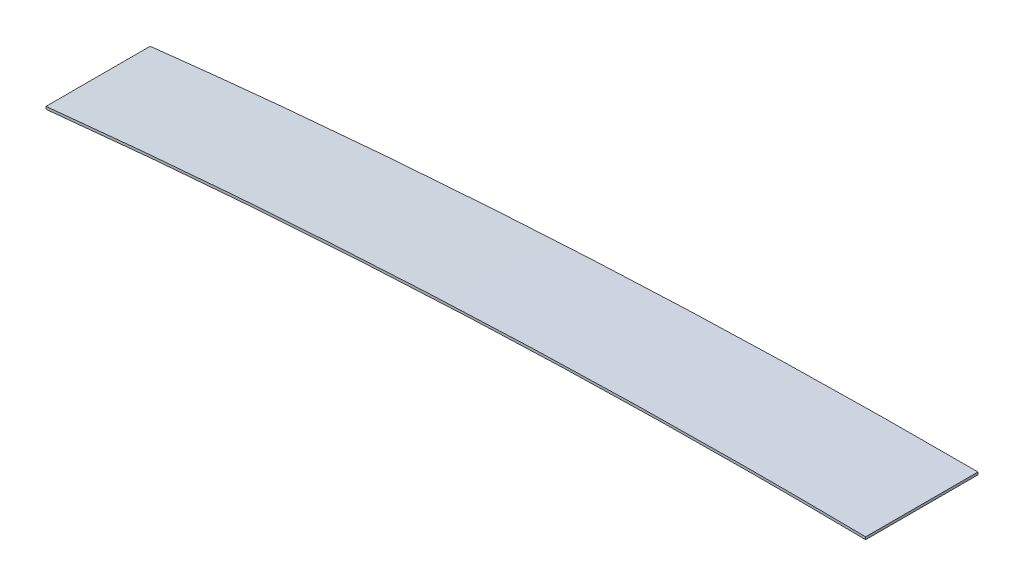
ISO-10303-21;
HEADER;
FILE_DESCRIPTION(('STEP AP214'),'2;1');
FILE_NAME('part.step','',(''),(''),'','','');
FILE_SCHEMA(('AUTOMOTIVE_DESIGN { 1 0 10303 214 1 1 1 1 }'));
ENDSEC;
DATA;
#1=APPLICATION_CONTEXT('core data for automotive mechanical design processes');
#2=APPLICATION_PROTOCOL_DEFINITION('international standard','automotive_design',2000,#1);
#3=PRODUCT_CONTEXT('',#1,'mechanical');
#4=PRODUCT('Part','Part','',(#3));
#5=PRODUCT_RELATED_PRODUCT_CATEGORY('part','',(#4));
#6=PRODUCT_DEFINITION_FORMATION('','',#4);
#7=PRODUCT_DEFINITION_CONTEXT('part definition',#1,'design');
#8=PRODUCT_DEFINITION('design','',#6,#7);
#9=PRODUCT_DEFINITION_SHAPE('','',#8);
#10=(LENGTH_UNIT() NAMED_UNIT(*) SI_UNIT(.MILLI.,.METRE.));
#11=(NAMED_UNIT(*) PLANE_ANGLE_UNIT() SI_UNIT($,.RADIAN.));
#12=(NAMED_UNIT(*) SI_UNIT($,.STERADIAN.) SOLID_ANGLE_UNIT());
#13=UNCERTAINTY_MEASURE_WITH_UNIT(LENGTH_MEASURE(1.E-05),#10,'distance_accuracy_value','');
#14=(GEOMETRIC_REPRESENTATION_CONTEXT(3) GLOBAL_UNCERTAINTY_ASSIGNED_CONTEXT((#13)) GLOBAL_UNIT_ASSIGNED_CONTEXT((#10,
#11,#12)) REPRESENTATION_CONTEXT('',''));
#15=CARTESIAN_POINT('',(0.,0.,0.));
#16=DIRECTION('',(0.,0.,1.));
#17=DIRECTION('',(1.,0.,0.));
#18=AXIS2_PLACEMENT_3D('',#15,#16,#17);
#19=CARTESIAN_POINT('',(-373.586879213494,-21.0130790659762,-20.257696549711));
#20=CARTESIAN_POINT('',(-243.741249137039,-4.49593376644683,-20.9066902700562));
#21=CARTESIAN_POINT('',(-112.967728991085,2.78477719258863,-21.560321185001));
#22=CARTESIAN_POINT('',(17.9088683591634,0.783133007793617,-22.2144678800755));
#23=CARTESIAN_POINT('',(-373.460690057183,-22.0050852639555,-20.257696549711));
#24=CARTESIAN_POINT('',(-243.661946833207,-5.49390425413375,-20.906690265834));
#25=CARTESIAN_POINT('',(-112.935762149143,1.78417133900721,-21.5603211892575));
#26=CARTESIAN_POINT('',(17.8935760138278,-0.216750057456583,-22.2144678800755));
#27=B_SPLINE_SURFACE_WITH_KNOTS('',1,3,((#19,#20,#21,#22),(#23,#24,#25,#26)),.UNSPECIFIED.,.F.,
.F.,.F.,(2,2),(4,4),(0.,1.),(0.,1.),.UNSPECIFIED.);
#28=CARTESIAN_POINT('',(-4.11588555663915E-13,0.999108312222187,-22.1249558754417));
#29=CARTESIAN_POINT('',(-13.5454695409797,1.11866202832961,-22.0572529887054));
#30=CARTESIAN_POINT('',(-27.0918173942769,1.1387887455524,-21.9895457176613));
#31=CARTESIAN_POINT('',(-54.1796663854699,0.980174185689572,-21.8541554091403));
#32=CARTESIAN_POINT('',(-67.721167839926,0.801486962380612,-21.7864723700788));
#33=CARTESIAN_POINT('',(-94.7974937159213,0.245348819005636,-21.651139671212));
#34=CARTESIAN_POINT('',(-108.332318919632,-0.132064015625083,-21.583490007496));
#35=CARTESIAN_POINT('',(-135.393461718731,-1.08553187463388,-21.4482332063033));
#36=CARTESIAN_POINT('',(-148.919780093761,-1.66156477058029,-21.3806260649293));
#37=CARTESIAN_POINT('',(-175.962079284226,-3.0121561533749,-21.2454634522907));
#38=CARTESIAN_POINT('',(-189.478060408904,-3.78670844817423,-21.1779079794804));
#39=CARTESIAN_POINT('',(-216.497855724423,-5.53421958691241,-21.0428578449614));
#40=CARTESIAN_POINT('',(-230.001669286627,-6.50718815095696,-20.9753631863948));
#41=CARTESIAN_POINT('',(-256.995299983507,-8.65141766536821,-20.8404438219593));
#42=CARTESIAN_POINT('',(-270.485115084357,-9.82270421969942,-20.7730191262552));
#43=CARTESIAN_POINT('',(-297.448922076372,-12.3634385163333,-20.6382488155984));
#44=CARTESIAN_POINT('',(-310.922910061776,-13.7329277102981,-20.5709032201659));
#45=CARTESIAN_POINT('',(-324.386118768315,-15.201250866892,-20.5036114970178));
#46=B_SPLINE_CURVE_WITH_KNOTS('',3,(#28,#29,#30,#31,#32,#33,#34,#35,#36,#37,#38,#39,#40,#41,#42,
#43,#44,#45),.UNSPECIFIED.,.F.,.F.,(4,2,2,2,2,2,2,2,4),(0.,40.6381352893386,81.2652245321455,
121.884530492786,162.499312483086,203.112827805659,243.728333199594,284.34908628697,
324.978347018093),.UNSPECIFIED.);
#47=CARTESIAN_POINT('',(-1.7796882199818E-13,0.999108312222187,-22.1249558754486));
#48=VERTEX_POINT('',#47);
#49=CARTESIAN_POINT('',(-324.386120103142,-15.2012510491896,-20.5036114903263));
#50=VERTEX_POINT('',#49);
#51=EDGE_CURVE('E183',#48,#50,#46,.T.);
#52=DIRECTION('',(-0.00882491285368237,-0.999961059698389,0.));
#53=VECTOR('',#52,1.);
#54=CARTESIAN_POINT('',(-0.00441245642683964,0.499127782372989,-22.1249558754417));
#55=LINE('',#54,#53);
#56=CARTESIAN_POINT('',(-0.00882491285374624,-0.000852747530403681,-22.1249558754417));
#57=VERTEX_POINT('',#56);
#58=EDGE_CURVE('E218',#48,#57,#55,.T.);
#59=CARTESIAN_POINT('',(17.8935760138278,-0.216750057456583,-22.2144678800755));
#60=CARTESIAN_POINT('',(-112.935762149143,1.78417133900721,-21.5603211892575));
#61=CARTESIAN_POINT('',(-243.661946833207,-5.49390425413375,-20.906690265834));
#62=CARTESIAN_POINT('',(-373.460690057183,-22.0050852639555,-20.257696549711));
#63=B_SPLINE_CURVE_WITH_KNOTS('',3,(#59,#60,#61,#62),.UNSPECIFIED.,.F.,.F.,(4,4),(0.,1.),.UNSPECIFIED.);
#64=CARTESIAN_POINT('',(-324.277700596053,-16.1953562435616,-20.5036114970178));
#65=VERTEX_POINT('',#64);
#66=EDGE_CURVE('E198',#57,#65,#63,.T.);
#67=CARTESIAN_POINT('',(-324.386118760404,-15.2012509394692,-20.5036114970178));
#68=CARTESIAN_POINT('',(-324.377083912715,-15.2840930541916,-20.5036114970178));
#69=CARTESIAN_POINT('',(-324.368049065026,-15.366935168914,-20.5036114970178));
#70=CARTESIAN_POINT('',(-324.349979369649,-15.5326193983589,-20.5036114970178));
#71=CARTESIAN_POINT('',(-324.34094452196,-15.6154615130813,-20.5036114970178));
#72=CARTESIAN_POINT('',(-324.313839981532,-15.8639878330564,-20.5036114970178));
#73=CARTESIAN_POINT('',(-324.295770288793,-16.029672038309,-20.5036114970178));
#74=CARTESIAN_POINT('',(-324.277700596053,-16.1953562435616,-20.5036114970178));
#75=B_SPLINE_CURVE_WITH_KNOTS('',3,(#67,#68,#69,#70,#71,#72,#73,#74),.UNSPECIFIED.,.F.,.F.,(4,2,
2,4),(0.,0.250000000000008,0.500000000000009,0.999999926992933),.UNSPECIFIED.);
#76=EDGE_CURVE('E235',#50,#65,#75,.T.);
#77=ORIENTED_EDGE('',*,*,#51,.F.);
#78=ORIENTED_EDGE('',*,*,#58,.T.);
#79=ORIENTED_EDGE('',*,*,#66,.T.);
#80=ORIENTED_EDGE('',*,*,#76,.F.);
#81=EDGE_LOOP('',(#77,#78,#79,#80));
#82=FACE_BOUND('',#81,.T.);
#83=ADVANCED_FACE('F172',(#82),#27,.F.);
#84=CARTESIAN_POINT('',(-373.586879213496,-21.0130790659766,20.2576965497109));
#85=CARTESIAN_POINT('',(-243.741249137041,-4.49593376644728,20.9066902700562));
#86=CARTESIAN_POINT('',(-112.967728991087,2.78477719258818,21.560321185001));
#87=CARTESIAN_POINT('',(17.9088683591614,0.783133007793173,22.2144678800755));
#88=CARTESIAN_POINT('',(-373.460690057184,-22.0050852639559,20.2576965497109));
#89=CARTESIAN_POINT('',(-243.661946833209,-5.49390425413421,20.906690265834));
#90=CARTESIAN_POINT('',(-112.935762149145,1.78417133900677,21.5603211892575));
#91=CARTESIAN_POINT('',(17.8935760138258,-0.216750057457027,22.2144678800755));
#92=B_SPLINE_SURFACE_WITH_KNOTS('',1,3,((#84,#85,#86,#87),(#88,#89,#90,#91)),.UNSPECIFIED.,.F.,
.F.,.F.,(2,2),(4,4),(0.,1.),(0.,1.),.UNSPECIFIED.);
#93=CARTESIAN_POINT('',(-373.460690057184,-22.0050852639559,20.2576965497109));
#94=CARTESIAN_POINT('',(-243.661946833209,-5.49390425413421,20.906690265834));
#95=CARTESIAN_POINT('',(-112.935762149145,1.78417133900677,21.5603211892575));
#96=CARTESIAN_POINT('',(17.8935760138258,-0.216750057457027,22.2144678800755));
#97=B_SPLINE_CURVE_WITH_KNOTS('',3,(#93,#94,#95,#96),.UNSPECIFIED.,.F.,.F.,(4,4),(0.,1.),.UNSPECIFIED.);
#98=CARTESIAN_POINT('',(-324.277701265505,-16.1953563165729,20.5036114936705));
#99=VERTEX_POINT('',#98);
#100=CARTESIAN_POINT('',(-0.00882491285376669,-0.000852747476665793,22.1249558754417));
#101=VERTEX_POINT('',#100);
#102=EDGE_CURVE('E234',#99,#101,#97,.T.);
#103=DIRECTION('',(-0.00882491285368294,-0.999961059698389,0.));
#104=VECTOR('',#103,1.);
#105=CARTESIAN_POINT('',(-0.00441245642692609,0.499127782372529,22.1249558754417));
#106=LINE('',#105,#104);
#107=CARTESIAN_POINT('',(-1.52828037090725E-13,0.999108312221725,22.1249558754417));
#108=VERTEX_POINT('',#107);
#109=EDGE_CURVE('E190',#108,#101,#106,.T.);
#110=CARTESIAN_POINT('',(-324.386118768325,-15.2012508668933,20.5036114969024));
#111=CARTESIAN_POINT('',(-310.922910061784,-13.7329277102993,20.5709032201006));
#112=CARTESIAN_POINT('',(-297.44892207638,-12.3634385163343,20.6382488155631));
#113=CARTESIAN_POINT('',(-270.485115084361,-9.82270421970007,20.7730191262487));
#114=CARTESIAN_POINT('',(-256.99529998351,-8.65141766536868,20.8404438219514));
#115=CARTESIAN_POINT('',(-230.001669286624,-6.50718815095702,20.9753631863613));
#116=CARTESIAN_POINT('',(-216.497855724416,-5.53421958691226,21.0428578449036));
#117=CARTESIAN_POINT('',(-189.478060408898,-3.78670844817418,21.1779079794328));
#118=CARTESIAN_POINT('',(-175.962079284222,-3.01215615337506,21.2454634522777));
#119=CARTESIAN_POINT('',(-148.919780093761,-1.66156477058065,21.3806260649424));
#120=CARTESIAN_POINT('',(-135.393461718731,-1.08553187463427,21.4482332063079));
#121=CARTESIAN_POINT('',(-108.332318919633,-0.132064015625476,21.5834900074914));
#122=CARTESIAN_POINT('',(-94.7974937159214,0.24534881900524,21.6511396712066));
#123=CARTESIAN_POINT('',(-67.7211678399258,0.801486962380201,21.7864723700752));
#124=CARTESIAN_POINT('',(-54.1796663854697,0.980174185689151,21.8541554091392));
#125=CARTESIAN_POINT('',(-27.0918173942767,1.13878874555196,21.9895457176635));
#126=CARTESIAN_POINT('',(-13.5454695409794,1.11866202832915,22.0572529887084));
#127=CARTESIAN_POINT('',(0.,0.999108312221723,22.124955875442));
#128=B_SPLINE_CURVE_WITH_KNOTS('',3,(#110,#111,#112,#113,#114,#115,#116,#117,#118,#119,#120,
#121,#122,#123,#124,#125,#126,#127),.UNSPECIFIED.,.F.,.F.,(4,2,2,2,2,2,2,2,4),(0.,
40.6292607311269,81.2500138185085,121.865519212454,162.479034535017,203.093816525317,
243.713122485958,284.340211728765,324.978347018104),.UNSPECIFIED.);
#129=CARTESIAN_POINT('',(-324.386119433572,-15.2012509761658,20.503611493673));
#130=VERTEX_POINT('',#129);
#131=EDGE_CURVE('E14',#130,#108,#128,.T.);
#132=CARTESIAN_POINT('',(-324.386118760404,-15.2012509394694,20.5036114970178));
#133=CARTESIAN_POINT('',(-324.38160133656,-15.2426719968306,20.5036114970178));
#134=CARTESIAN_POINT('',(-324.377083912715,-15.2840930541918,20.5036114970178));
#135=CARTESIAN_POINT('',(-324.368049065026,-15.3669351689143,20.5036114970178));
#136=CARTESIAN_POINT('',(-324.363531641182,-15.4083562262755,20.5036114970178));
#137=CARTESIAN_POINT('',(-324.354496793493,-15.4911983409979,20.5036114970178));
#138=CARTESIAN_POINT('',(-324.349979369649,-15.5326193983591,20.5036114970178));
#139=CARTESIAN_POINT('',(-324.34094452196,-15.6154615130816,20.5036114970178));
#140=CARTESIAN_POINT('',(-324.336427098115,-15.6568825704428,20.5036114970178));
#141=CARTESIAN_POINT('',(-324.327392250427,-15.7397246851652,20.5036114970178));
#142=CARTESIAN_POINT('',(-324.322874826582,-15.7811457425264,20.5036114970178));
#143=CARTESIAN_POINT('',(-324.313839978893,-15.8639878572488,20.5036114970178));
#144=CARTESIAN_POINT('',(-324.309322555049,-15.9054089146101,20.5036114970178));
#145=CARTESIAN_POINT('',(-324.295770286154,-16.0296720625015,20.5036114970178));
#146=CARTESIAN_POINT('',(-324.286735441104,-16.1125141530316,20.5036114970178));
#147=CARTESIAN_POINT('',(-324.277700596053,-16.1953562435618,20.5036114970178));
#148=B_SPLINE_CURVE_WITH_KNOTS('',3,(#132,#133,#134,#135,#136,#137,#138,#139,#140,#141,#142,
#143,#144,#145,#146,#147),.UNSPECIFIED.,.F.,.F.,(4,2,2,2,2,2,2,4),(0.,0.125,0.250000000000011,
0.37500000000001,0.500000000000005,0.625000000000002,0.750000000000007,0.999999926992926),.UNSPECIFIED.);
#149=EDGE_CURVE('E321',#130,#99,#148,.T.);
#150=ORIENTED_EDGE('',*,*,#102,.T.);
#151=ORIENTED_EDGE('',*,*,#109,.F.);
#152=ORIENTED_EDGE('',*,*,#131,.F.);
#153=ORIENTED_EDGE('',*,*,#149,.T.);
#154=EDGE_LOOP('',(#150,#151,#152,#153));
#155=FACE_BOUND('',#154,.T.);
#156=ADVANCED_FACE('F358',(#155),#92,.T.);
#157=CARTESIAN_POINT('',(-373.460690057184,-22.0050852639559,20.2576965497109));
#158=CARTESIAN_POINT('',(-373.460690057183,-22.0050852639555,-20.257696549711));
#159=CARTESIAN_POINT('',(-243.661946833209,-5.49390425413421,20.906690265834));
#160=CARTESIAN_POINT('',(-243.661946833207,-5.49390425413376,-20.906690265834));
#161=CARTESIAN_POINT('',(-112.935762149145,1.78417133900677,21.5603211892575));
#162=CARTESIAN_POINT('',(-112.935762149143,1.78417133900721,-21.5603211892575));
#163=CARTESIAN_POINT('',(17.8935760138258,-0.216750057457027,22.2144678800755));
#164=CARTESIAN_POINT('',(17.8935760138278,-0.216750057456583,-22.2144678800755));
#165=B_SPLINE_SURFACE_WITH_KNOTS('',3,1,((#157,#158),(#159,#160),(#161,#162),(#163,#164)),
.UNSPECIFIED.,.F.,.F.,.F.,(4,4),(2,2),(0.,1.),(0.,1.),.UNSPECIFIED.);
#166=OFFSET_SURFACE('',#165,1.,.F.);
#167=ORIENTED_EDGE('',*,*,#131,.T.);
#168=DIRECTION('',(0.,0.,-1.));
#169=VECTOR('',#168,1.);
#170=CARTESIAN_POINT('',(-3.57477549894469E-13,0.999108312221959,0.));
#171=LINE('',#170,#169);
#172=EDGE_CURVE('E223',#108,#48,#171,.T.);
#173=ORIENTED_EDGE('',*,*,#172,.T.);
#174=ORIENTED_EDGE('',*,*,#51,.T.);
#175=DIRECTION('',(0.,0.,1.));
#176=VECTOR('',#175,1.);
#177=CARTESIAN_POINT('',(-324.386118768319,-15.2012508668926,0.));
#178=LINE('',#177,#176);
#179=EDGE_CURVE('E227',#130,#50,#178,.F.);
#180=ORIENTED_EDGE('',*,*,#179,.F.);
#181=EDGE_LOOP('',(#167,#173,#174,#180));
#182=FACE_BOUND('',#181,.T.);
#183=ADVANCED_FACE('F261',(#182),#166,.T.);
#184=CARTESIAN_POINT('',(-373.460690057184,-22.0050852639559,20.2576965497109));
#185=CARTESIAN_POINT('',(-373.460690057183,-22.0050852639555,-20.257696549711));
#186=CARTESIAN_POINT('',(-243.661946833209,-5.49390425413421,20.906690265834));
#187=CARTESIAN_POINT('',(-243.661946833207,-5.49390425413376,-20.906690265834));
#188=CARTESIAN_POINT('',(-112.935762149145,1.78417133900677,21.5603211892575));
#189=CARTESIAN_POINT('',(-112.935762149143,1.78417133900721,-21.5603211892575));
#190=CARTESIAN_POINT('',(17.8935760138258,-0.216750057457027,22.2144678800755));
#191=CARTESIAN_POINT('',(17.8935760138278,-0.216750057456583,-22.2144678800755));
#192=B_SPLINE_SURFACE_WITH_KNOTS('',3,1,((#184,#185),(#186,#187),(#188,#189),(#190,#191)),
.UNSPECIFIED.,.F.,.F.,.F.,(4,4),(2,2),(0.,1.),(0.,1.),.UNSPECIFIED.);
#193=DIRECTION('',(0.,0.,-1.));
#194=VECTOR('',#193,1.);
#195=CARTESIAN_POINT('',(-0.00882491285383391,-0.00085274747643452,0.));
#196=LINE('',#195,#194);
#197=EDGE_CURVE('E216',#101,#57,#196,.T.);
#198=DIRECTION('',(0.,0.,-1.));
#199=VECTOR('',#198,1.);
#200=CARTESIAN_POINT('',(-324.277700596053,-16.1953562435617,0.));
#201=LINE('',#200,#199);
#202=EDGE_CURVE('E232',#99,#65,#201,.T.);
#203=ORIENTED_EDGE('',*,*,#197,.F.);
#204=ORIENTED_EDGE('',*,*,#102,.F.);
#205=ORIENTED_EDGE('',*,*,#202,.T.);
#206=ORIENTED_EDGE('',*,*,#66,.F.);
#207=EDGE_LOOP('',(#203,#204,#205,#206));
#208=FACE_BOUND('',#207,.T.);
#209=ADVANCED_FACE('F231',(#208),#192,.F.);
#210=CARTESIAN_POINT('',(-324.277700596053,-16.1953562435618,20.9131307942796));
#211=CARTESIAN_POINT('',(-324.277700596053,-16.1953562435618,20.7764436649052));
#212=CARTESIAN_POINT('',(-324.277700596053,-16.1953562435618,20.6397565355308));
#213=CARTESIAN_POINT('',(-324.277700596053,-16.1953562435618,20.5030694061564));
#214=CARTESIAN_POINT('',(-324.277700596053,-16.1953562435617,6.83435646871881));
#215=CARTESIAN_POINT('',(-324.277700596053,-16.1953562435617,-6.83435646871883));
#216=CARTESIAN_POINT('',(-324.277700596053,-16.1953562435616,-20.5030694061565));
#217=CARTESIAN_POINT('',(-324.277700596053,-16.1953562435616,-20.6397565355309));
#218=CARTESIAN_POINT('',(-324.277700596053,-16.1953562435616,-20.7764436649052));
#219=CARTESIAN_POINT('',(-324.277700596053,-16.1953562435616,-20.9131307942796));
#220=CARTESIAN_POINT('',(-324.386118768319,-15.2012508668927,20.9131307942796));
#221=CARTESIAN_POINT('',(-324.386118768319,-15.2012508668927,20.7764436649052));
#222=CARTESIAN_POINT('',(-324.386118768319,-15.2012508668927,20.6397565355308));
#223=CARTESIAN_POINT('',(-324.386118768319,-15.2012508668927,20.5030694061565));
#224=CARTESIAN_POINT('',(-324.386118768319,-15.2012508668926,6.83435646871882));
#225=CARTESIAN_POINT('',(-324.386118768319,-15.2012508668925,-6.83435646871884));
#226=CARTESIAN_POINT('',(-324.386118768319,-15.2012508668925,-20.5030694061565));
#227=CARTESIAN_POINT('',(-324.386118768319,-15.2012508668925,-20.6397565355308));
#228=CARTESIAN_POINT('',(-324.386118768319,-15.2012508668925,-20.7764436649052));
#229=CARTESIAN_POINT('',(-324.386118768319,-15.2012508668925,-20.9131307942796));
#230=B_SPLINE_SURFACE_WITH_KNOTS('',1,3,((#210,#211,#212,#213,#214,#215,#216,#217,#218,#219),
(#220,#221,#222,#223,#224,#225,#226,#227,#228,#229)),.UNSPECIFIED.,.F.,.F.,.F.,(2,2),(4,3,3,4),
(0.,1.),(-0.000410061388123129,0.,0.0410061388123129,0.0414162002004361),.UNSPECIFIED.);
#231=ORIENTED_EDGE('',*,*,#179,.T.);
#232=ORIENTED_EDGE('',*,*,#76,.T.);
#233=ORIENTED_EDGE('',*,*,#202,.F.);
#234=ORIENTED_EDGE('',*,*,#149,.F.);
#235=EDGE_LOOP('',(#231,#232,#233,#234));
#236=FACE_BOUND('',#235,.T.);
#237=ADVANCED_FACE('F260',(#236),#230,.T.);
#238=CARTESIAN_POINT('',(-0.0088249128543992,-0.000852747476654328,22.1249558754417));
#239=CARTESIAN_POINT('',(-0.008824912854399,-0.000852747476500534,7.37498529181389));
#240=CARTESIAN_POINT('',(-0.00882491285368103,-0.000852747476359258,-7.37498529181391));
#241=CARTESIAN_POINT('',(-0.00882491285368082,-0.000852747476205468,-22.1249558754417));
#242=CARTESIAN_POINT('',(-7.16495005687046E-13,0.999108312221735,22.1249558754417));
#243=CARTESIAN_POINT('',(-7.16495005687046E-13,0.999108312221889,7.37498529181391));
#244=CARTESIAN_POINT('',(0.,0.99910831222203,-7.3749852918139));
#245=CARTESIAN_POINT('',(0.,0.999108312222184,-22.1249558754417));
#246=B_SPLINE_SURFACE_WITH_KNOTS('',1,3,((#238,#239,#240,#241),(#242,#243,#244,#245)),
.UNSPECIFIED.,.F.,.F.,.F.,(2,2),(4,4),(0.,1.),(0.,0.0442499117508834),.UNSPECIFIED.);
#247=ORIENTED_EDGE('',*,*,#58,.F.);
#248=ORIENTED_EDGE('',*,*,#172,.F.);
#249=ORIENTED_EDGE('',*,*,#109,.T.);
#250=ORIENTED_EDGE('',*,*,#197,.T.);
#251=EDGE_LOOP('',(#247,#248,#249,#250));
#252=FACE_BOUND('',#251,.T.);
#253=ADVANCED_FACE('F217',(#252),#246,.F.);
#254=CLOSED_SHELL('',(#83,#156,#183,#209,#237,#253));
#255=MANIFOLD_SOLID_BREP('B2',#254);
#256=ADVANCED_BREP_SHAPE_REPRESENTATION('',(#18,#255),#14);
#257=SHAPE_DEFINITION_REPRESENTATION(#9,#256);
ENDSEC;
END-ISO-10303-21;
